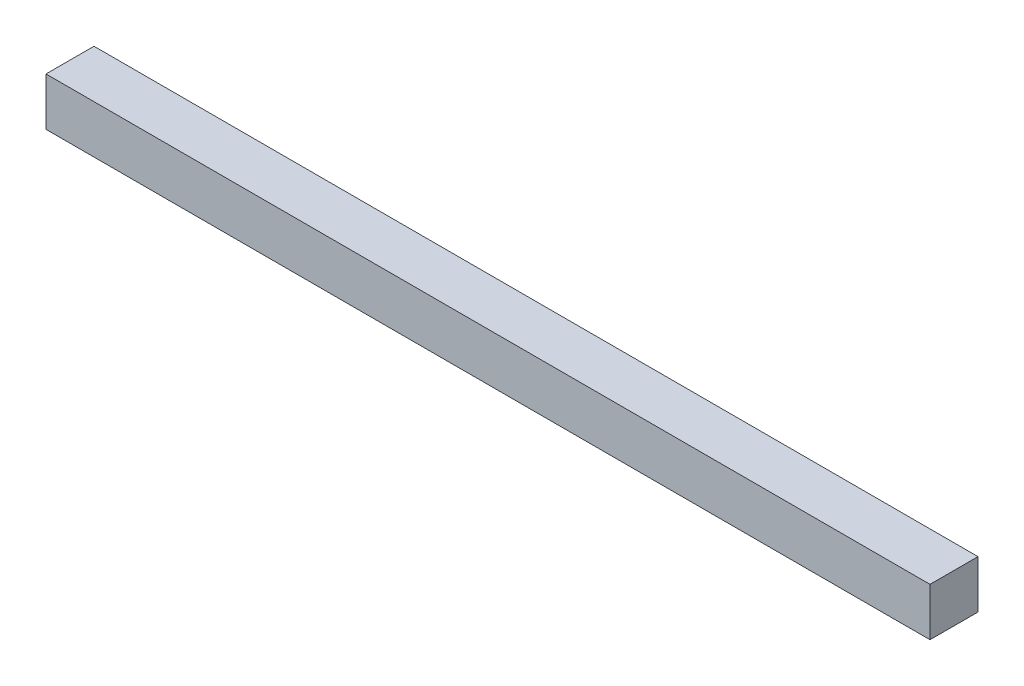
ISO-10303-21;
HEADER;
FILE_DESCRIPTION(('STEP AP214'),'2;1');
FILE_NAME('part.step','',(''),(''),'','','');
FILE_SCHEMA(('AUTOMOTIVE_DESIGN { 1 0 10303 214 1 1 1 1 }'));
ENDSEC;
DATA;
#1=APPLICATION_CONTEXT('core data for automotive mechanical design processes');
#2=APPLICATION_PROTOCOL_DEFINITION('international standard','automotive_design',2000,#1);
#3=PRODUCT_CONTEXT('',#1,'mechanical');
#4=PRODUCT('Part','Part','',(#3));
#5=PRODUCT_RELATED_PRODUCT_CATEGORY('part','',(#4));
#6=PRODUCT_DEFINITION_FORMATION('','',#4);
#7=PRODUCT_DEFINITION_CONTEXT('part definition',#1,'design');
#8=PRODUCT_DEFINITION('design','',#6,#7);
#9=PRODUCT_DEFINITION_SHAPE('','',#8);
#10=(LENGTH_UNIT() NAMED_UNIT(*) SI_UNIT(.MILLI.,.METRE.));
#11=(NAMED_UNIT(*) PLANE_ANGLE_UNIT() SI_UNIT($,.RADIAN.));
#12=(NAMED_UNIT(*) SI_UNIT($,.STERADIAN.) SOLID_ANGLE_UNIT());
#13=UNCERTAINTY_MEASURE_WITH_UNIT(LENGTH_MEASURE(1.E-05),#10,'distance_accuracy_value','');
#14=(GEOMETRIC_REPRESENTATION_CONTEXT(3) GLOBAL_UNCERTAINTY_ASSIGNED_CONTEXT((#13)) GLOBAL_UNIT_ASSIGNED_CONTEXT((#10,
#11,#12)) REPRESENTATION_CONTEXT('',''));
#15=CARTESIAN_POINT('',(0.,0.,0.));
#16=DIRECTION('',(0.,0.,1.));
#17=DIRECTION('',(1.,0.,0.));
#18=AXIS2_PLACEMENT_3D('',#15,#16,#17);
#19=CARTESIAN_POINT('',(701.675,-19.05,-19.05));
#20=DIRECTION('',(0.,0.,1.));
#21=DIRECTION('',(1.,0.,0.));
#22=AXIS2_PLACEMENT_3D('',#19,#20,#21);
#23=PLANE('',#22);
#24=DIRECTION('',(0.,1.,0.));
#25=VECTOR('',#24,1.);
#26=CARTESIAN_POINT('',(0.,-19.05,-19.05));
#27=LINE('',#26,#25);
#28=CARTESIAN_POINT('',(0.,-19.05,-19.05));
#29=VERTEX_POINT('',#28);
#30=CARTESIAN_POINT('',(0.,19.05,-19.05));
#31=VERTEX_POINT('',#30);
#32=EDGE_CURVE('E95',#29,#31,#27,.T.);
#33=ORIENTED_EDGE('',*,*,#32,.T.);
#34=DIRECTION('',(-1.,0.,0.));
#35=VECTOR('',#34,1.);
#36=CARTESIAN_POINT('',(701.675,19.05,-19.05));
#37=LINE('',#36,#35);
#38=CARTESIAN_POINT('',(701.675,19.05,-19.05));
#39=VERTEX_POINT('',#38);
#40=EDGE_CURVE('E11',#39,#31,#37,.T.);
#41=ORIENTED_EDGE('',*,*,#40,.F.);
#42=DIRECTION('',(0.,1.,0.));
#43=VECTOR('',#42,1.);
#44=CARTESIAN_POINT('',(701.675,-19.05,-19.05));
#45=LINE('',#44,#43);
#46=CARTESIAN_POINT('',(701.675,-19.05,-19.05));
#47=VERTEX_POINT('',#46);
#48=EDGE_CURVE('E83',#47,#39,#45,.T.);
#49=ORIENTED_EDGE('',*,*,#48,.F.);
#50=DIRECTION('',(-1.,0.,0.));
#51=VECTOR('',#50,1.);
#52=CARTESIAN_POINT('',(701.675,-19.05,-19.05));
#53=LINE('',#52,#51);
#54=EDGE_CURVE('E91',#47,#29,#53,.T.);
#55=ORIENTED_EDGE('',*,*,#54,.T.);
#56=EDGE_LOOP('',(#33,#41,#49,#55));
#57=FACE_BOUND('',#56,.T.);
#58=ADVANCED_FACE('F32',(#57),#23,.F.);
#59=CARTESIAN_POINT('',(701.675,19.05,19.05));
#60=DIRECTION('',(0.,-1.,0.));
#61=DIRECTION('',(0.,0.,-1.));
#62=AXIS2_PLACEMENT_3D('',#59,#60,#61);
#63=PLANE('',#62);
#64=DIRECTION('',(0.,0.,1.));
#65=VECTOR('',#64,1.);
#66=CARTESIAN_POINT('',(0.,19.05,19.05));
#67=LINE('',#66,#65);
#68=CARTESIAN_POINT('',(0.,19.05,19.05));
#69=VERTEX_POINT('',#68);
#70=EDGE_CURVE('E87',#31,#69,#67,.T.);
#71=ORIENTED_EDGE('',*,*,#70,.T.);
#72=DIRECTION('',(-1.,0.,0.));
#73=VECTOR('',#72,1.);
#74=CARTESIAN_POINT('',(701.675,19.05,19.05));
#75=LINE('',#74,#73);
#76=CARTESIAN_POINT('',(701.675,19.05,19.05));
#77=VERTEX_POINT('',#76);
#78=EDGE_CURVE('E40',#77,#69,#75,.T.);
#79=ORIENTED_EDGE('',*,*,#78,.F.);
#80=DIRECTION('',(0.,0.,1.));
#81=VECTOR('',#80,1.);
#82=CARTESIAN_POINT('',(701.675,19.05,19.05));
#83=LINE('',#82,#81);
#84=EDGE_CURVE('E78',#39,#77,#83,.T.);
#85=ORIENTED_EDGE('',*,*,#84,.F.);
#86=ORIENTED_EDGE('',*,*,#40,.T.);
#87=EDGE_LOOP('',(#71,#79,#85,#86));
#88=FACE_BOUND('',#87,.T.);
#89=ADVANCED_FACE('F86',(#88),#63,.F.);
#90=CARTESIAN_POINT('',(701.675,-19.05,19.05));
#91=DIRECTION('',(0.,0.,-1.));
#92=DIRECTION('',(-1.,0.,0.));
#93=AXIS2_PLACEMENT_3D('',#90,#91,#92);
#94=PLANE('',#93);
#95=DIRECTION('',(0.,-1.,0.));
#96=VECTOR('',#95,1.);
#97=CARTESIAN_POINT('',(0.,-19.05,19.05));
#98=LINE('',#97,#96);
#99=CARTESIAN_POINT('',(0.,-19.05,19.05));
#100=VERTEX_POINT('',#99);
#101=EDGE_CURVE('E65',#69,#100,#98,.T.);
#102=ORIENTED_EDGE('',*,*,#101,.T.);
#103=DIRECTION('',(-1.,0.,0.));
#104=VECTOR('',#103,1.);
#105=CARTESIAN_POINT('',(701.675,-19.05,19.05));
#106=LINE('',#105,#104);
#107=CARTESIAN_POINT('',(701.675,-19.05,19.05));
#108=VERTEX_POINT('',#107);
#109=EDGE_CURVE('E88',#108,#100,#106,.T.);
#110=ORIENTED_EDGE('',*,*,#109,.F.);
#111=DIRECTION('',(0.,-1.,0.));
#112=VECTOR('',#111,1.);
#113=CARTESIAN_POINT('',(701.675,-19.05,19.05));
#114=LINE('',#113,#112);
#115=EDGE_CURVE('E81',#77,#108,#114,.T.);
#116=ORIENTED_EDGE('',*,*,#115,.F.);
#117=ORIENTED_EDGE('',*,*,#78,.T.);
#118=EDGE_LOOP('',(#102,#110,#116,#117));
#119=FACE_BOUND('',#118,.T.);
#120=ADVANCED_FACE('F89',(#119),#94,.F.);
#121=CARTESIAN_POINT('',(701.675,-19.05,19.05));
#122=DIRECTION('',(0.,1.,0.));
#123=DIRECTION('',(0.,0.,1.));
#124=AXIS2_PLACEMENT_3D('',#121,#122,#123);
#125=PLANE('',#124);
#126=DIRECTION('',(0.,0.,-1.));
#127=VECTOR('',#126,1.);
#128=CARTESIAN_POINT('',(0.,-19.05,19.05));
#129=LINE('',#128,#127);
#130=EDGE_CURVE('E71',#100,#29,#129,.T.);
#131=ORIENTED_EDGE('',*,*,#130,.T.);
#132=ORIENTED_EDGE('',*,*,#54,.F.);
#133=DIRECTION('',(0.,0.,-1.));
#134=VECTOR('',#133,1.);
#135=CARTESIAN_POINT('',(701.675,-19.05,19.05));
#136=LINE('',#135,#134);
#137=EDGE_CURVE('E48',#108,#47,#136,.T.);
#138=ORIENTED_EDGE('',*,*,#137,.F.);
#139=ORIENTED_EDGE('',*,*,#109,.T.);
#140=EDGE_LOOP('',(#131,#132,#138,#139));
#141=FACE_BOUND('',#140,.T.);
#142=ADVANCED_FACE('F102',(#141),#125,.F.);
#143=CARTESIAN_POINT('',(701.675,0.,0.));
#144=DIRECTION('',(-1.,0.,0.));
#145=DIRECTION('',(0.,0.,1.));
#146=AXIS2_PLACEMENT_3D('',#143,#144,#145);
#147=PLANE('',#146);
#148=ORIENTED_EDGE('',*,*,#48,.T.);
#149=ORIENTED_EDGE('',*,*,#84,.T.);
#150=ORIENTED_EDGE('',*,*,#115,.T.);
#151=ORIENTED_EDGE('',*,*,#137,.T.);
#152=EDGE_LOOP('',(#148,#149,#150,#151));
#153=FACE_BOUND('',#152,.T.);
#154=ADVANCED_FACE('F79',(#153),#147,.F.);
#155=CARTESIAN_POINT('',(0.,0.,0.));
#156=DIRECTION('',(-1.,0.,0.));
#157=DIRECTION('',(0.,0.,1.));
#158=AXIS2_PLACEMENT_3D('',#155,#156,#157);
#159=PLANE('',#158);
#160=ORIENTED_EDGE('',*,*,#32,.F.);
#161=ORIENTED_EDGE('',*,*,#130,.F.);
#162=ORIENTED_EDGE('',*,*,#101,.F.);
#163=ORIENTED_EDGE('',*,*,#70,.F.);
#164=EDGE_LOOP('',(#160,#161,#162,#163));
#165=FACE_BOUND('',#164,.T.);
#166=ADVANCED_FACE('F105',(#165),#159,.T.);
#167=CLOSED_SHELL('',(#58,#89,#120,#142,#154,#166));
#168=MANIFOLD_SOLID_BREP('B2',#167);
#169=ADVANCED_BREP_SHAPE_REPRESENTATION('',(#18,#168),#14);
#170=SHAPE_DEFINITION_REPRESENTATION(#9,#169);
ENDSEC;
END-ISO-10303-21;
